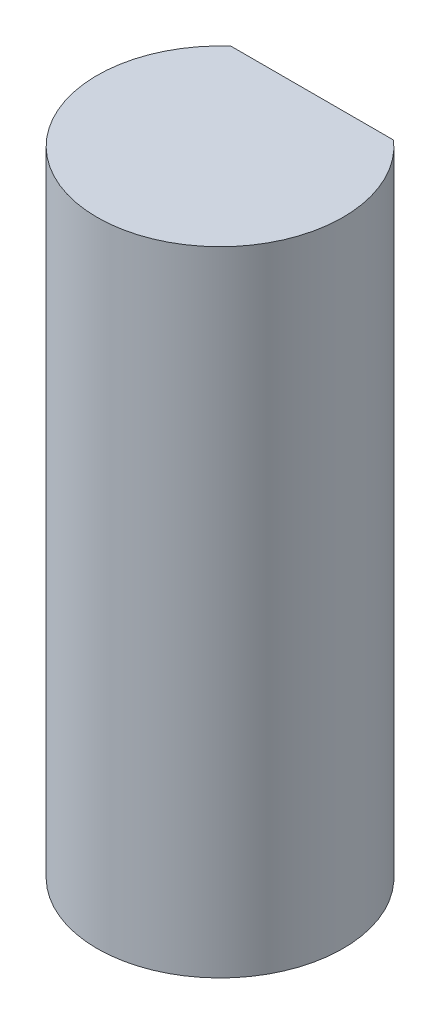
ISO-10303-21;
HEADER;
FILE_DESCRIPTION(('STEP AP214'),'2;1');
FILE_NAME('part.step','',(''),(''),'','','');
FILE_SCHEMA(('AUTOMOTIVE_DESIGN { 1 0 10303 214 1 1 1 1 }'));
ENDSEC;
DATA;
#1=APPLICATION_CONTEXT('core data for automotive mechanical design processes');
#2=APPLICATION_PROTOCOL_DEFINITION('international standard','automotive_design',2000,#1);
#3=PRODUCT_CONTEXT('',#1,'mechanical');
#4=PRODUCT('Part','Part','',(#3));
#5=PRODUCT_RELATED_PRODUCT_CATEGORY('part','',(#4));
#6=PRODUCT_DEFINITION_FORMATION('','',#4);
#7=PRODUCT_DEFINITION_CONTEXT('part definition',#1,'design');
#8=PRODUCT_DEFINITION('design','',#6,#7);
#9=PRODUCT_DEFINITION_SHAPE('','',#8);
#10=(LENGTH_UNIT() NAMED_UNIT(*) SI_UNIT(.MILLI.,.METRE.));
#11=(NAMED_UNIT(*) PLANE_ANGLE_UNIT() SI_UNIT($,.RADIAN.));
#12=(NAMED_UNIT(*) SI_UNIT($,.STERADIAN.) SOLID_ANGLE_UNIT());
#13=UNCERTAINTY_MEASURE_WITH_UNIT(LENGTH_MEASURE(1.E-05),#10,'distance_accuracy_value','');
#14=(GEOMETRIC_REPRESENTATION_CONTEXT(3) GLOBAL_UNCERTAINTY_ASSIGNED_CONTEXT((#13)) GLOBAL_UNIT_ASSIGNED_CONTEXT((#10,
#11,#12)) REPRESENTATION_CONTEXT('',''));
#15=CARTESIAN_POINT('',(0.,0.,0.));
#16=DIRECTION('',(0.,0.,1.));
#17=DIRECTION('',(1.,0.,0.));
#18=AXIS2_PLACEMENT_3D('',#15,#16,#17);
#19=CARTESIAN_POINT('',(0.,20.6,0.));
#20=DIRECTION('',(0.,-1.,0.));
#21=DIRECTION('',(0.,0.,-1.));
#22=AXIS2_PLACEMENT_3D('',#19,#20,#21);
#23=CYLINDRICAL_SURFACE('',#22,4.);
#24=CARTESIAN_POINT('',(0.,20.6,0.));
#25=DIRECTION('',(0.,1.,0.));
#26=DIRECTION('',(0.,0.,1.));
#27=AXIS2_PLACEMENT_3D('',#24,#25,#26);
#28=CIRCLE('',#27,4.);
#29=CARTESIAN_POINT('',(-2.64575131106459,20.6,-3.));
#30=VERTEX_POINT('',#29);
#31=CARTESIAN_POINT('',(2.64575131106459,20.6,-3.));
#32=VERTEX_POINT('',#31);
#33=EDGE_CURVE('E11',#30,#32,#28,.T.);
#34=ORIENTED_EDGE('',*,*,#33,.F.);
#35=DIRECTION('',(0.,1.,0.));
#36=VECTOR('',#35,1.);
#37=CARTESIAN_POINT('',(-2.64575131106459,10.6,-3.));
#38=LINE('',#37,#36);
#39=CARTESIAN_POINT('',(-2.64575131106459,10.6,-3.));
#40=VERTEX_POINT('',#39);
#41=EDGE_CURVE('E44',#40,#30,#38,.T.);
#42=ORIENTED_EDGE('',*,*,#41,.F.);
#43=CARTESIAN_POINT('',(0.,10.6,0.));
#44=DIRECTION('',(0.,1.,0.));
#45=DIRECTION('',(0.,0.,-1.));
#46=AXIS2_PLACEMENT_3D('',#43,#44,#45);
#47=CIRCLE('',#46,4.);
#48=CARTESIAN_POINT('',(2.64575131106459,10.6,-3.));
#49=VERTEX_POINT('',#48);
#50=EDGE_CURVE('E59',#49,#40,#47,.T.);
#51=ORIENTED_EDGE('',*,*,#50,.F.);
#52=DIRECTION('',(0.,1.,0.));
#53=VECTOR('',#52,1.);
#54=CARTESIAN_POINT('',(2.64575131106459,10.6,-3.));
#55=LINE('',#54,#53);
#56=EDGE_CURVE('E50',#49,#32,#55,.T.);
#57=ORIENTED_EDGE('',*,*,#56,.T.);
#58=EDGE_LOOP('',(#34,#42,#51,#57));
#59=FACE_BOUND('',#58,.T.);
#60=CARTESIAN_POINT('',(0.,0.,0.));
#61=DIRECTION('',(0.,1.,0.));
#62=DIRECTION('',(0.,0.,1.));
#63=AXIS2_PLACEMENT_3D('',#60,#61,#62);
#64=CIRCLE('',#63,4.);
#65=CARTESIAN_POINT('',(0.,0.,4.));
#66=VERTEX_POINT('',#65);
#67=EDGE_CURVE('E33',#66,#66,#64,.T.);
#68=ORIENTED_EDGE('',*,*,#67,.T.);
#69=EDGE_LOOP('',(#68));
#70=FACE_BOUND('',#69,.T.);
#71=ADVANCED_FACE('F30',(#59,#70),#23,.T.);
#72=CARTESIAN_POINT('',(0.,20.6,0.));
#73=DIRECTION('',(0.,1.,0.));
#74=DIRECTION('',(0.,0.,1.));
#75=AXIS2_PLACEMENT_3D('',#72,#73,#74);
#76=PLANE('',#75);
#77=DIRECTION('',(1.,0.,0.));
#78=VECTOR('',#77,1.);
#79=CARTESIAN_POINT('',(-2.64575131106459,20.6,-3.));
#80=LINE('',#79,#78);
#81=EDGE_CURVE('E55',#30,#32,#80,.T.);
#82=ORIENTED_EDGE('',*,*,#81,.F.);
#83=ORIENTED_EDGE('',*,*,#33,.T.);
#84=EDGE_LOOP('',(#82,#83));
#85=FACE_BOUND('',#84,.T.);
#86=ADVANCED_FACE('F65',(#85),#76,.T.);
#87=CARTESIAN_POINT('',(0.,0.,0.));
#88=DIRECTION('',(0.,1.,0.));
#89=DIRECTION('',(0.,0.,1.));
#90=AXIS2_PLACEMENT_3D('',#87,#88,#89);
#91=PLANE('',#90);
#92=ORIENTED_EDGE('',*,*,#67,.F.);
#93=EDGE_LOOP('',(#92));
#94=FACE_BOUND('',#93,.T.);
#95=ADVANCED_FACE('F67',(#94),#91,.F.);
#96=CARTESIAN_POINT('',(-2.64575131106459,10.6,-3.));
#97=DIRECTION('',(0.,0.,1.));
#98=DIRECTION('',(1.,0.,0.));
#99=AXIS2_PLACEMENT_3D('',#96,#97,#98);
#100=PLANE('',#99);
#101=ORIENTED_EDGE('',*,*,#81,.T.);
#102=ORIENTED_EDGE('',*,*,#56,.F.);
#103=DIRECTION('',(1.,0.,0.));
#104=VECTOR('',#103,1.);
#105=CARTESIAN_POINT('',(-2.64575131106459,10.6,-3.));
#106=LINE('',#105,#104);
#107=EDGE_CURVE('E82',#40,#49,#106,.T.);
#108=ORIENTED_EDGE('',*,*,#107,.F.);
#109=ORIENTED_EDGE('',*,*,#41,.T.);
#110=EDGE_LOOP('',(#101,#102,#108,#109));
#111=FACE_BOUND('',#110,.T.);
#112=ADVANCED_FACE('F56',(#111),#100,.F.);
#113=CARTESIAN_POINT('',(0.,10.6,0.));
#114=DIRECTION('',(0.,-1.,0.));
#115=DIRECTION('',(0.,0.,-1.));
#116=AXIS2_PLACEMENT_3D('',#113,#114,#115);
#117=PLANE('',#116);
#118=ORIENTED_EDGE('',*,*,#50,.T.);
#119=ORIENTED_EDGE('',*,*,#107,.T.);
#120=EDGE_LOOP('',(#118,#119));
#121=FACE_BOUND('',#120,.T.);
#122=ADVANCED_FACE('F77',(#121),#117,.F.);
#123=CLOSED_SHELL('',(#71,#86,#95,#112,#122));
#124=MANIFOLD_SOLID_BREP('B2',#123);
#125=ADVANCED_BREP_SHAPE_REPRESENTATION('',(#18,#124),#14);
#126=SHAPE_DEFINITION_REPRESENTATION(#9,#125);
ENDSEC;
END-ISO-10303-21;
